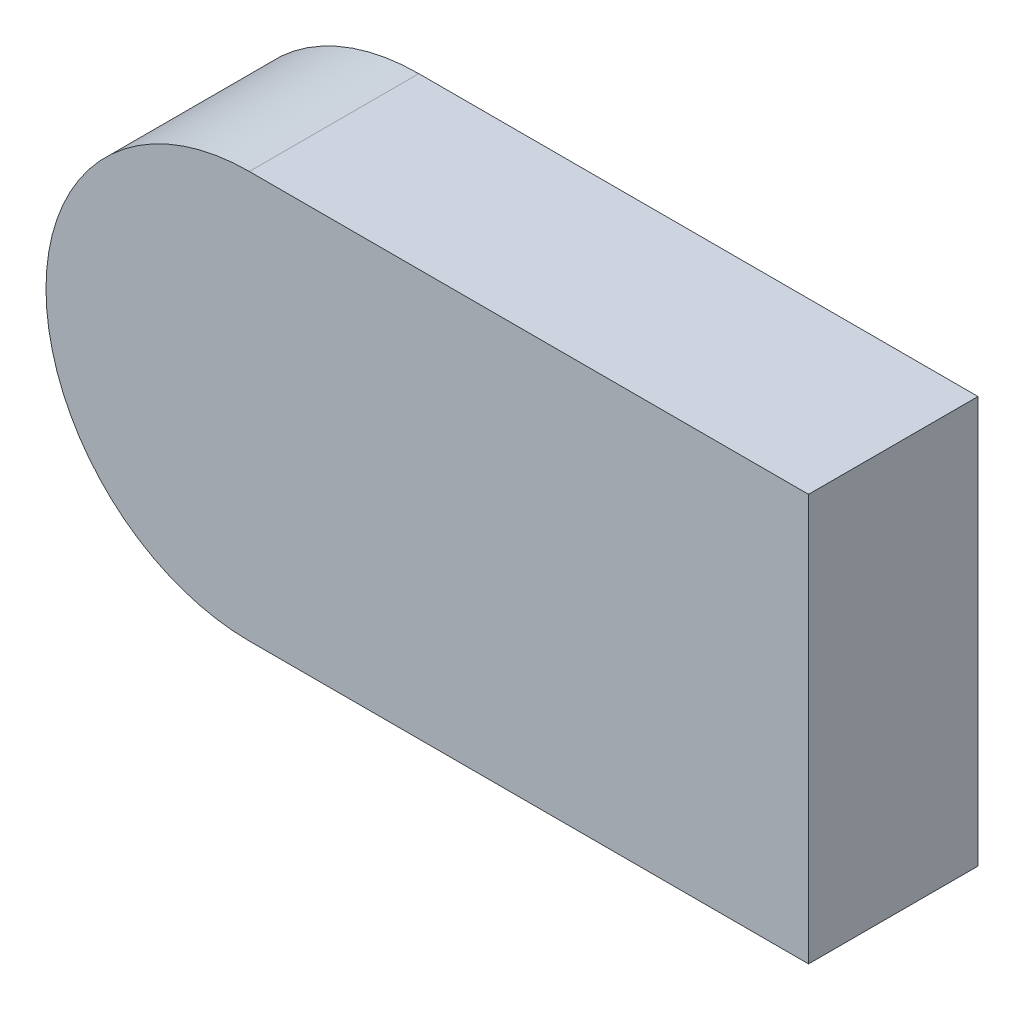
ISO-10303-21;
HEADER;
FILE_DESCRIPTION(('STEP AP214'),'2;1');
FILE_NAME('part.step','',(''),(''),'','','');
FILE_SCHEMA(('AUTOMOTIVE_DESIGN { 1 0 10303 214 1 1 1 1 }'));
ENDSEC;
DATA;
#1=APPLICATION_CONTEXT('core data for automotive mechanical design processes');
#2=APPLICATION_PROTOCOL_DEFINITION('international standard','automotive_design',2000,#1);
#3=PRODUCT_CONTEXT('',#1,'mechanical');
#4=PRODUCT('Part','Part','',(#3));
#5=PRODUCT_RELATED_PRODUCT_CATEGORY('part','',(#4));
#6=PRODUCT_DEFINITION_FORMATION('','',#4);
#7=PRODUCT_DEFINITION_CONTEXT('part definition',#1,'design');
#8=PRODUCT_DEFINITION('design','',#6,#7);
#9=PRODUCT_DEFINITION_SHAPE('','',#8);
#10=(LENGTH_UNIT() NAMED_UNIT(*) SI_UNIT(.MILLI.,.METRE.));
#11=(NAMED_UNIT(*) PLANE_ANGLE_UNIT() SI_UNIT($,.RADIAN.));
#12=(NAMED_UNIT(*) SI_UNIT($,.STERADIAN.) SOLID_ANGLE_UNIT());
#13=UNCERTAINTY_MEASURE_WITH_UNIT(LENGTH_MEASURE(1.E-05),#10,'distance_accuracy_value','');
#14=(GEOMETRIC_REPRESENTATION_CONTEXT(3) GLOBAL_UNCERTAINTY_ASSIGNED_CONTEXT((#13)) GLOBAL_UNIT_ASSIGNED_CONTEXT((#10,
#11,#12)) REPRESENTATION_CONTEXT('',''));
#15=CARTESIAN_POINT('',(0.,0.,0.));
#16=DIRECTION('',(0.,0.,1.));
#17=DIRECTION('',(1.,0.,0.));
#18=AXIS2_PLACEMENT_3D('',#15,#16,#17);
#19=CARTESIAN_POINT('',(4.05,-2.37,0.));
#20=DIRECTION('',(0.,-1.,0.));
#21=DIRECTION('',(-1.,0.,0.));
#22=AXIS2_PLACEMENT_3D('',#19,#20,#21);
#23=PLANE('',#22);
#24=DIRECTION('',(0.,0.,1.));
#25=VECTOR('',#24,1.);
#26=CARTESIAN_POINT('',(4.05,-2.37,0.));
#27=LINE('',#26,#25);
#28=CARTESIAN_POINT('',(4.05,-2.37,0.));
#29=VERTEX_POINT('',#28);
#30=CARTESIAN_POINT('',(4.05,-2.37,0.1));
#31=VERTEX_POINT('',#30);
#32=EDGE_CURVE('E11',#29,#31,#27,.T.);
#33=ORIENTED_EDGE('',*,*,#32,.T.);
#34=DIRECTION('',(-1.,0.,0.));
#35=VECTOR('',#34,1.);
#36=CARTESIAN_POINT('',(4.05,-2.37,0.1));
#37=LINE('',#36,#35);
#38=CARTESIAN_POINT('',(3.72,-2.37,0.1));
#39=VERTEX_POINT('',#38);
#40=EDGE_CURVE('E24',#31,#39,#37,.T.);
#41=ORIENTED_EDGE('',*,*,#40,.T.);
#42=DIRECTION('',(0.,0.,1.));
#43=VECTOR('',#42,1.);
#44=CARTESIAN_POINT('',(3.72,-2.37,0.));
#45=LINE('',#44,#43);
#46=CARTESIAN_POINT('',(3.72,-2.37,0.));
#47=VERTEX_POINT('',#46);
#48=EDGE_CURVE('E86',#47,#39,#45,.T.);
#49=ORIENTED_EDGE('',*,*,#48,.F.);
#50=DIRECTION('',(-1.,0.,0.));
#51=VECTOR('',#50,1.);
#52=CARTESIAN_POINT('',(4.05,-2.37,0.));
#53=LINE('',#52,#51);
#54=EDGE_CURVE('E83',#29,#47,#53,.T.);
#55=ORIENTED_EDGE('',*,*,#54,.F.);
#56=EDGE_LOOP('',(#33,#41,#49,#55));
#57=FACE_BOUND('',#56,.T.);
#58=ADVANCED_FACE('F17',(#57),#23,.T.);
#59=CARTESIAN_POINT('',(3.72,-2.25,0.));
#60=DIRECTION('',(0.,0.,-1.));
#61=DIRECTION('',(1.,0.,0.));
#62=AXIS2_PLACEMENT_3D('',#59,#60,#61);
#63=CYLINDRICAL_SURFACE('',#62,0.12);
#64=CARTESIAN_POINT('',(3.72,-2.25,0.));
#65=DIRECTION('',(0.,0.,1.));
#66=DIRECTION('',(1.,0.,0.));
#67=AXIS2_PLACEMENT_3D('',#64,#65,#66);
#68=CIRCLE('',#67,0.12);
#69=CARTESIAN_POINT('',(3.72,-2.13,0.));
#70=VERTEX_POINT('',#69);
#71=EDGE_CURVE('E80',#70,#47,#68,.T.);
#72=ORIENTED_EDGE('',*,*,#71,.T.);
#73=ORIENTED_EDGE('',*,*,#48,.T.);
#74=CARTESIAN_POINT('',(3.72,-2.25,0.1));
#75=DIRECTION('',(0.,0.,1.));
#76=DIRECTION('',(1.,0.,0.));
#77=AXIS2_PLACEMENT_3D('',#74,#75,#76);
#78=CIRCLE('',#77,0.12);
#79=CARTESIAN_POINT('',(3.72,-2.13,0.1));
#80=VERTEX_POINT('',#79);
#81=EDGE_CURVE('E78',#80,#39,#78,.T.);
#82=ORIENTED_EDGE('',*,*,#81,.F.);
#83=DIRECTION('',(0.,0.,1.));
#84=VECTOR('',#83,1.);
#85=CARTESIAN_POINT('',(3.72,-2.13,0.));
#86=LINE('',#85,#84);
#87=EDGE_CURVE('E67',#70,#80,#86,.T.);
#88=ORIENTED_EDGE('',*,*,#87,.F.);
#89=EDGE_LOOP('',(#72,#73,#82,#88));
#90=FACE_BOUND('',#89,.T.);
#91=ADVANCED_FACE('F89',(#90),#63,.T.);
#92=CARTESIAN_POINT('',(4.05,-2.13,0.));
#93=DIRECTION('',(0.,-1.,0.));
#94=DIRECTION('',(-1.,0.,0.));
#95=AXIS2_PLACEMENT_3D('',#92,#93,#94);
#96=PLANE('',#95);
#97=DIRECTION('',(-1.,0.,0.));
#98=VECTOR('',#97,1.);
#99=CARTESIAN_POINT('',(4.05,-2.13,0.));
#100=LINE('',#99,#98);
#101=CARTESIAN_POINT('',(4.05,-2.13,0.));
#102=VERTEX_POINT('',#101);
#103=EDGE_CURVE('E70',#102,#70,#100,.T.);
#104=ORIENTED_EDGE('',*,*,#103,.T.);
#105=ORIENTED_EDGE('',*,*,#87,.T.);
#106=DIRECTION('',(-1.,0.,0.));
#107=VECTOR('',#106,1.);
#108=CARTESIAN_POINT('',(4.05,-2.13,0.1));
#109=LINE('',#108,#107);
#110=CARTESIAN_POINT('',(4.05,-2.13,0.1));
#111=VERTEX_POINT('',#110);
#112=EDGE_CURVE('E61',#111,#80,#109,.T.);
#113=ORIENTED_EDGE('',*,*,#112,.F.);
#114=DIRECTION('',(0.,0.,1.));
#115=VECTOR('',#114,1.);
#116=CARTESIAN_POINT('',(4.05,-2.13,0.));
#117=LINE('',#116,#115);
#118=EDGE_CURVE('E51',#102,#111,#117,.T.);
#119=ORIENTED_EDGE('',*,*,#118,.F.);
#120=EDGE_LOOP('',(#104,#105,#113,#119));
#121=FACE_BOUND('',#120,.T.);
#122=ADVANCED_FACE('F65',(#121),#96,.F.);
#123=CARTESIAN_POINT('',(4.05,-2.37,0.));
#124=DIRECTION('',(-1.,0.,0.));
#125=DIRECTION('',(0.,1.,0.));
#126=AXIS2_PLACEMENT_3D('',#123,#124,#125);
#127=PLANE('',#126);
#128=DIRECTION('',(0.,1.,0.));
#129=VECTOR('',#128,1.);
#130=CARTESIAN_POINT('',(4.05,-2.37,0.));
#131=LINE('',#130,#129);
#132=EDGE_CURVE('E57',#29,#102,#131,.T.);
#133=ORIENTED_EDGE('',*,*,#132,.T.);
#134=ORIENTED_EDGE('',*,*,#118,.T.);
#135=DIRECTION('',(0.,1.,0.));
#136=VECTOR('',#135,1.);
#137=CARTESIAN_POINT('',(4.05,-2.37,0.1));
#138=LINE('',#137,#136);
#139=EDGE_CURVE('E55',#31,#111,#138,.T.);
#140=ORIENTED_EDGE('',*,*,#139,.F.);
#141=ORIENTED_EDGE('',*,*,#32,.F.);
#142=EDGE_LOOP('',(#133,#134,#140,#141));
#143=FACE_BOUND('',#142,.T.);
#144=ADVANCED_FACE('F53',(#143),#127,.F.);
#145=CARTESIAN_POINT('',(3.849490847913,-2.25,0.));
#146=DIRECTION('',(0.,0.,-1.));
#147=DIRECTION('',(-1.,0.,0.));
#148=AXIS2_PLACEMENT_3D('',#145,#146,#147);
#149=PLANE('',#148);
#150=ORIENTED_EDGE('',*,*,#54,.T.);
#151=ORIENTED_EDGE('',*,*,#71,.F.);
#152=ORIENTED_EDGE('',*,*,#103,.F.);
#153=ORIENTED_EDGE('',*,*,#132,.F.);
#154=EDGE_LOOP('',(#150,#151,#152,#153));
#155=FACE_BOUND('',#154,.T.);
#156=ADVANCED_FACE('F91',(#155),#149,.T.);
#157=CARTESIAN_POINT('',(3.849490847913,-2.25,0.1));
#158=DIRECTION('',(0.,0.,-1.));
#159=DIRECTION('',(-1.,0.,0.));
#160=AXIS2_PLACEMENT_3D('',#157,#158,#159);
#161=PLANE('',#160);
#162=ORIENTED_EDGE('',*,*,#139,.T.);
#163=ORIENTED_EDGE('',*,*,#112,.T.);
#164=ORIENTED_EDGE('',*,*,#81,.T.);
#165=ORIENTED_EDGE('',*,*,#40,.F.);
#166=EDGE_LOOP('',(#162,#163,#164,#165));
#167=FACE_BOUND('',#166,.T.);
#168=ADVANCED_FACE('F72',(#167),#161,.F.);
#169=CLOSED_SHELL('',(#58,#91,#122,#144,#156,#168));
#170=MANIFOLD_SOLID_BREP('B1',#169);
#171=ADVANCED_BREP_SHAPE_REPRESENTATION('',(#18,#170),#14);
#172=SHAPE_DEFINITION_REPRESENTATION(#9,#171);
ENDSEC;
END-ISO-10303-21;
